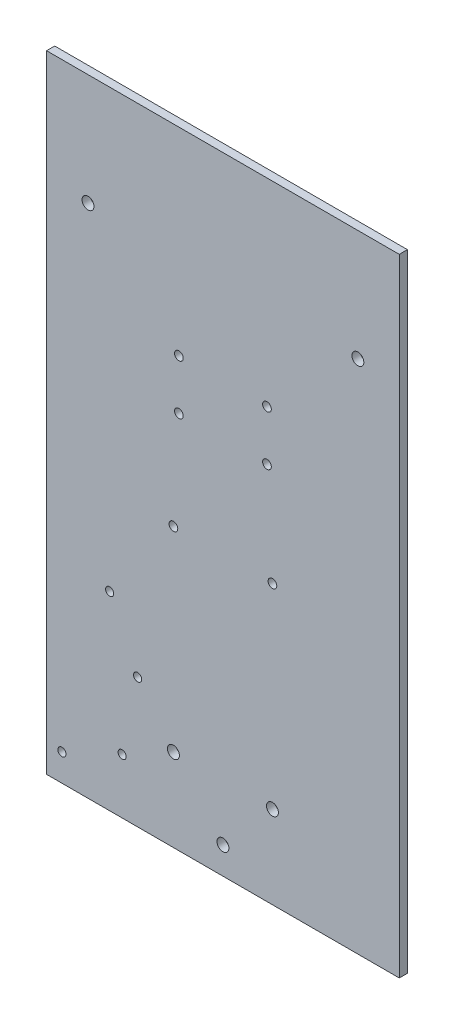
ISO-10303-21;
HEADER;
FILE_DESCRIPTION(('STEP AP214'),'2;1');
FILE_NAME('part.step','',(''),(''),'','','');
FILE_SCHEMA(('AUTOMOTIVE_DESIGN { 1 0 10303 214 1 1 1 1 }'));
ENDSEC;
DATA;
#1=APPLICATION_CONTEXT('core data for automotive mechanical design processes');
#2=APPLICATION_PROTOCOL_DEFINITION('international standard','automotive_design',2000,#1);
#3=PRODUCT_CONTEXT('',#1,'mechanical');
#4=PRODUCT('Part','Part','',(#3));
#5=PRODUCT_RELATED_PRODUCT_CATEGORY('part','',(#4));
#6=PRODUCT_DEFINITION_FORMATION('','',#4);
#7=PRODUCT_DEFINITION_CONTEXT('part definition',#1,'design');
#8=PRODUCT_DEFINITION('design','',#6,#7);
#9=PRODUCT_DEFINITION_SHAPE('','',#8);
#10=(LENGTH_UNIT() NAMED_UNIT(*) SI_UNIT(.MILLI.,.METRE.));
#11=(NAMED_UNIT(*) PLANE_ANGLE_UNIT() SI_UNIT($,.RADIAN.));
#12=(NAMED_UNIT(*) SI_UNIT($,.STERADIAN.) SOLID_ANGLE_UNIT());
#13=UNCERTAINTY_MEASURE_WITH_UNIT(LENGTH_MEASURE(1.E-05),#10,'distance_accuracy_value','');
#14=(GEOMETRIC_REPRESENTATION_CONTEXT(3) GLOBAL_UNCERTAINTY_ASSIGNED_CONTEXT((#13)) GLOBAL_UNIT_ASSIGNED_CONTEXT((#10,
#11,#12)) REPRESENTATION_CONTEXT('',''));
#15=CARTESIAN_POINT('',(0.,0.,0.));
#16=DIRECTION('',(0.,0.,1.));
#17=DIRECTION('',(1.,0.,0.));
#18=AXIS2_PLACEMENT_3D('',#15,#16,#17);
#19=CARTESIAN_POINT('',(-75.,115.5,12.5));
#20=DIRECTION('',(0.,-1.,0.));
#21=DIRECTION('',(0.,0.,-1.));
#22=AXIS2_PLACEMENT_3D('',#19,#20,#21);
#23=PLANE('',#22);
#24=DIRECTION('',(-1.,0.,0.));
#25=VECTOR('',#24,1.);
#26=CARTESIAN_POINT('',(65.,115.5,3.));
#27=LINE('',#26,#25);
#28=CARTESIAN_POINT('',(65.,115.5,3.));
#29=VERTEX_POINT('',#28);
#30=CARTESIAN_POINT('',(-65.,115.5,3.));
#31=VERTEX_POINT('',#30);
#32=EDGE_CURVE('E80',#29,#31,#27,.T.);
#33=ORIENTED_EDGE('',*,*,#32,.F.);
#34=DIRECTION('',(0.,0.,1.));
#35=VECTOR('',#34,1.);
#36=CARTESIAN_POINT('',(65.,115.5,0.));
#37=LINE('',#36,#35);
#38=CARTESIAN_POINT('',(65.,115.5,0.));
#39=VERTEX_POINT('',#38);
#40=EDGE_CURVE('E88',#39,#29,#37,.T.);
#41=ORIENTED_EDGE('',*,*,#40,.F.);
#42=DIRECTION('',(-1.,0.,0.));
#43=VECTOR('',#42,1.);
#44=CARTESIAN_POINT('',(-75.,115.5,0.));
#45=LINE('',#44,#43);
#46=CARTESIAN_POINT('',(-65.,115.5,0.));
#47=VERTEX_POINT('',#46);
#48=EDGE_CURVE('E46',#39,#47,#45,.T.);
#49=ORIENTED_EDGE('',*,*,#48,.T.);
#50=DIRECTION('',(0.,0.,1.));
#51=VECTOR('',#50,1.);
#52=CARTESIAN_POINT('',(-65.,115.5,0.));
#53=LINE('',#52,#51);
#54=EDGE_CURVE('E91',#47,#31,#53,.T.);
#55=ORIENTED_EDGE('',*,*,#54,.T.);
#56=EDGE_LOOP('',(#33,#41,#49,#55));
#57=FACE_BOUND('',#56,.T.);
#58=ADVANCED_FACE('F38',(#57),#23,.F.);
#59=CARTESIAN_POINT('',(-75.,-115.5,12.5));
#60=DIRECTION('',(0.,1.,0.));
#61=DIRECTION('',(0.,0.,1.));
#62=AXIS2_PLACEMENT_3D('',#59,#60,#61);
#63=PLANE('',#62);
#64=DIRECTION('',(1.,0.,0.));
#65=VECTOR('',#64,1.);
#66=CARTESIAN_POINT('',(65.,-115.5,3.));
#67=LINE('',#66,#65);
#68=CARTESIAN_POINT('',(-65.,-115.5,3.));
#69=VERTEX_POINT('',#68);
#70=CARTESIAN_POINT('',(65.,-115.5,3.));
#71=VERTEX_POINT('',#70);
#72=EDGE_CURVE('E53',#69,#71,#67,.T.);
#73=ORIENTED_EDGE('',*,*,#72,.F.);
#74=DIRECTION('',(0.,0.,1.));
#75=VECTOR('',#74,1.);
#76=CARTESIAN_POINT('',(-65.,-115.5,0.));
#77=LINE('',#76,#75);
#78=CARTESIAN_POINT('',(-65.,-115.5,0.));
#79=VERTEX_POINT('',#78);
#80=EDGE_CURVE('E109',#79,#69,#77,.T.);
#81=ORIENTED_EDGE('',*,*,#80,.F.);
#82=DIRECTION('',(1.,0.,0.));
#83=VECTOR('',#82,1.);
#84=CARTESIAN_POINT('',(-75.,-115.5,0.));
#85=LINE('',#84,#83);
#86=CARTESIAN_POINT('',(65.,-115.5,0.));
#87=VERTEX_POINT('',#86);
#88=EDGE_CURVE('E11',#79,#87,#85,.T.);
#89=ORIENTED_EDGE('',*,*,#88,.T.);
#90=DIRECTION('',(0.,0.,1.));
#91=VECTOR('',#90,1.);
#92=CARTESIAN_POINT('',(65.,-115.5,0.));
#93=LINE('',#92,#91);
#94=EDGE_CURVE('E60',#87,#71,#93,.T.);
#95=ORIENTED_EDGE('',*,*,#94,.T.);
#96=EDGE_LOOP('',(#73,#81,#89,#95));
#97=FACE_BOUND('',#96,.T.);
#98=ADVANCED_FACE('F190',(#97),#63,.F.);
#99=CARTESIAN_POINT('',(49.73,74.5,0.));
#100=DIRECTION('',(0.,0.,1.));
#101=DIRECTION('',(1.,0.,0.));
#102=AXIS2_PLACEMENT_3D('',#99,#100,#101);
#103=CYLINDRICAL_SURFACE('',#102,2.2);
#104=CARTESIAN_POINT('',(49.73,74.5,0.));
#105=DIRECTION('',(0.,0.,1.));
#106=DIRECTION('',(1.,0.,0.));
#107=AXIS2_PLACEMENT_3D('',#104,#105,#106);
#108=CIRCLE('',#107,2.2);
#109=CARTESIAN_POINT('',(51.93,74.5,0.));
#110=VERTEX_POINT('',#109);
#111=EDGE_CURVE('E175',#110,#110,#108,.T.);
#112=ORIENTED_EDGE('',*,*,#111,.F.);
#113=EDGE_LOOP('',(#112));
#114=FACE_BOUND('',#113,.T.);
#115=CARTESIAN_POINT('',(49.73,74.5,3.));
#116=DIRECTION('',(0.,0.,1.));
#117=DIRECTION('',(1.,0.,0.));
#118=AXIS2_PLACEMENT_3D('',#115,#116,#117);
#119=CIRCLE('',#118,2.2);
#120=CARTESIAN_POINT('',(51.93,74.5,3.));
#121=VERTEX_POINT('',#120);
#122=EDGE_CURVE('E252',#121,#121,#119,.F.);
#123=ORIENTED_EDGE('',*,*,#122,.F.);
#124=EDGE_LOOP('',(#123));
#125=FACE_BOUND('',#124,.T.);
#126=ADVANCED_FACE('F299',(#114,#125),#103,.F.);
#127=CARTESIAN_POINT('',(-49.73,74.5,0.));
#128=DIRECTION('',(0.,0.,1.));
#129=DIRECTION('',(1.,0.,0.));
#130=AXIS2_PLACEMENT_3D('',#127,#128,#129);
#131=CYLINDRICAL_SURFACE('',#130,2.2);
#132=CARTESIAN_POINT('',(-49.73,74.5,0.));
#133=DIRECTION('',(0.,0.,1.));
#134=DIRECTION('',(1.,0.,0.));
#135=AXIS2_PLACEMENT_3D('',#132,#133,#134);
#136=CIRCLE('',#135,2.2);
#137=CARTESIAN_POINT('',(-47.53,74.5,0.));
#138=VERTEX_POINT('',#137);
#139=EDGE_CURVE('E176',#138,#138,#136,.T.);
#140=ORIENTED_EDGE('',*,*,#139,.F.);
#141=EDGE_LOOP('',(#140));
#142=FACE_BOUND('',#141,.T.);
#143=CARTESIAN_POINT('',(-49.73,74.5,3.));
#144=DIRECTION('',(0.,0.,1.));
#145=DIRECTION('',(1.,0.,0.));
#146=AXIS2_PLACEMENT_3D('',#143,#144,#145);
#147=CIRCLE('',#146,2.2);
#148=CARTESIAN_POINT('',(-47.53,74.5,3.));
#149=VERTEX_POINT('',#148);
#150=EDGE_CURVE('E248',#149,#149,#147,.F.);
#151=ORIENTED_EDGE('',*,*,#150,.F.);
#152=EDGE_LOOP('',(#151));
#153=FACE_BOUND('',#152,.T.);
#154=ADVANCED_FACE('F302',(#142,#153),#131,.F.);
#155=CARTESIAN_POINT('',(-18.25,-12.95,0.));
#156=DIRECTION('',(0.,0.,1.));
#157=DIRECTION('',(1.,0.,0.));
#158=AXIS2_PLACEMENT_3D('',#155,#156,#157);
#159=CYLINDRICAL_SURFACE('',#158,1.6);
#160=CARTESIAN_POINT('',(-18.25,-12.95,0.));
#161=DIRECTION('',(0.,0.,1.));
#162=DIRECTION('',(1.,0.,0.));
#163=AXIS2_PLACEMENT_3D('',#160,#161,#162);
#164=CIRCLE('',#163,1.6);
#165=CARTESIAN_POINT('',(-16.65,-12.95,0.));
#166=VERTEX_POINT('',#165);
#167=EDGE_CURVE('E160',#166,#166,#164,.T.);
#168=ORIENTED_EDGE('',*,*,#167,.F.);
#169=EDGE_LOOP('',(#168));
#170=FACE_BOUND('',#169,.T.);
#171=CARTESIAN_POINT('',(-18.25,-12.95,3.));
#172=DIRECTION('',(0.,0.,1.));
#173=DIRECTION('',(1.,0.,0.));
#174=AXIS2_PLACEMENT_3D('',#171,#172,#173);
#175=CIRCLE('',#174,1.6);
#176=CARTESIAN_POINT('',(-16.65,-12.95,3.));
#177=VERTEX_POINT('',#176);
#178=EDGE_CURVE('E244',#177,#177,#175,.F.);
#179=ORIENTED_EDGE('',*,*,#178,.F.);
#180=EDGE_LOOP('',(#179));
#181=FACE_BOUND('',#180,.T.);
#182=ADVANCED_FACE('F322',(#170,#181),#159,.F.);
#183=CARTESIAN_POINT('',(-31.45,-67.68,0.));
#184=DIRECTION('',(0.,0.,1.));
#185=DIRECTION('',(1.,0.,0.));
#186=AXIS2_PLACEMENT_3D('',#183,#184,#185);
#187=CYLINDRICAL_SURFACE('',#186,1.5);
#188=CARTESIAN_POINT('',(-31.45,-67.68,0.));
#189=DIRECTION('',(0.,0.,1.));
#190=DIRECTION('',(1.,0.,0.));
#191=AXIS2_PLACEMENT_3D('',#188,#189,#190);
#192=CIRCLE('',#191,1.5);
#193=CARTESIAN_POINT('',(-29.95,-67.68,0.));
#194=VERTEX_POINT('',#193);
#195=EDGE_CURVE('E148',#194,#194,#192,.T.);
#196=ORIENTED_EDGE('',*,*,#195,.F.);
#197=EDGE_LOOP('',(#196));
#198=FACE_BOUND('',#197,.T.);
#199=CARTESIAN_POINT('',(-31.45,-67.68,3.));
#200=DIRECTION('',(0.,0.,1.));
#201=DIRECTION('',(1.,0.,0.));
#202=AXIS2_PLACEMENT_3D('',#199,#200,#201);
#203=CIRCLE('',#202,1.5);
#204=CARTESIAN_POINT('',(-29.95,-67.68,3.));
#205=VERTEX_POINT('',#204);
#206=EDGE_CURVE('E240',#205,#205,#203,.F.);
#207=ORIENTED_EDGE('',*,*,#206,.F.);
#208=EDGE_LOOP('',(#207));
#209=FACE_BOUND('',#208,.T.);
#210=ADVANCED_FACE('F326',(#198,#209),#187,.F.);
#211=CARTESIAN_POINT('',(-41.75,-45.48,0.));
#212=DIRECTION('',(0.,0.,1.));
#213=DIRECTION('',(1.,0.,0.));
#214=AXIS2_PLACEMENT_3D('',#211,#212,#213);
#215=CYLINDRICAL_SURFACE('',#214,1.5);
#216=CARTESIAN_POINT('',(-41.75,-45.48,0.));
#217=DIRECTION('',(0.,0.,1.));
#218=DIRECTION('',(1.,0.,0.));
#219=AXIS2_PLACEMENT_3D('',#216,#217,#218);
#220=CIRCLE('',#219,1.5);
#221=CARTESIAN_POINT('',(-40.25,-45.48,0.));
#222=VERTEX_POINT('',#221);
#223=EDGE_CURVE('E144',#222,#222,#220,.T.);
#224=ORIENTED_EDGE('',*,*,#223,.F.);
#225=EDGE_LOOP('',(#224));
#226=FACE_BOUND('',#225,.T.);
#227=CARTESIAN_POINT('',(-41.75,-45.48,3.));
#228=DIRECTION('',(0.,0.,1.));
#229=DIRECTION('',(1.,0.,0.));
#230=AXIS2_PLACEMENT_3D('',#227,#228,#229);
#231=CIRCLE('',#230,1.5);
#232=CARTESIAN_POINT('',(-40.25,-45.48,3.));
#233=VERTEX_POINT('',#232);
#234=EDGE_CURVE('E236',#233,#233,#231,.F.);
#235=ORIENTED_EDGE('',*,*,#234,.F.);
#236=EDGE_LOOP('',(#235));
#237=FACE_BOUND('',#236,.T.);
#238=ADVANCED_FACE('F346',(#226,#237),#215,.F.);
#239=CARTESIAN_POINT('',(18.25,-12.95,0.));
#240=DIRECTION('',(0.,0.,1.));
#241=DIRECTION('',(1.,0.,0.));
#242=AXIS2_PLACEMENT_3D('',#239,#240,#241);
#243=CYLINDRICAL_SURFACE('',#242,1.6);
#244=CARTESIAN_POINT('',(18.25,-12.95,0.));
#245=DIRECTION('',(0.,0.,1.));
#246=DIRECTION('',(1.,0.,0.));
#247=AXIS2_PLACEMENT_3D('',#244,#245,#246);
#248=CIRCLE('',#247,1.6);
#249=CARTESIAN_POINT('',(19.85,-12.95,0.));
#250=VERTEX_POINT('',#249);
#251=EDGE_CURVE('E140',#250,#250,#248,.T.);
#252=ORIENTED_EDGE('',*,*,#251,.F.);
#253=EDGE_LOOP('',(#252));
#254=FACE_BOUND('',#253,.T.);
#255=CARTESIAN_POINT('',(18.25,-12.95,3.));
#256=DIRECTION('',(0.,0.,1.));
#257=DIRECTION('',(1.,0.,0.));
#258=AXIS2_PLACEMENT_3D('',#255,#256,#257);
#259=CIRCLE('',#258,1.6);
#260=CARTESIAN_POINT('',(19.85,-12.95,3.));
#261=VERTEX_POINT('',#260);
#262=EDGE_CURVE('E232',#261,#261,#259,.F.);
#263=ORIENTED_EDGE('',*,*,#262,.F.);
#264=EDGE_LOOP('',(#263));
#265=FACE_BOUND('',#264,.T.);
#266=ADVANCED_FACE('F349',(#254,#265),#243,.F.);
#267=CARTESIAN_POINT('',(-59.34,-105.5,0.));
#268=DIRECTION('',(0.,0.,1.));
#269=DIRECTION('',(1.,0.,0.));
#270=AXIS2_PLACEMENT_3D('',#267,#268,#269);
#271=CYLINDRICAL_SURFACE('',#270,1.5);
#272=CARTESIAN_POINT('',(-59.34,-105.5,0.));
#273=DIRECTION('',(0.,0.,1.));
#274=DIRECTION('',(1.,0.,0.));
#275=AXIS2_PLACEMENT_3D('',#272,#273,#274);
#276=CIRCLE('',#275,1.5);
#277=CARTESIAN_POINT('',(-57.84,-105.5,0.));
#278=VERTEX_POINT('',#277);
#279=EDGE_CURVE('E139',#278,#278,#276,.T.);
#280=ORIENTED_EDGE('',*,*,#279,.F.);
#281=EDGE_LOOP('',(#280));
#282=FACE_BOUND('',#281,.T.);
#283=CARTESIAN_POINT('',(-59.34,-105.5,3.));
#284=DIRECTION('',(0.,0.,1.));
#285=DIRECTION('',(1.,0.,0.));
#286=AXIS2_PLACEMENT_3D('',#283,#284,#285);
#287=CIRCLE('',#286,1.5);
#288=CARTESIAN_POINT('',(-57.84,-105.5,3.));
#289=VERTEX_POINT('',#288);
#290=EDGE_CURVE('E228',#289,#289,#287,.F.);
#291=ORIENTED_EDGE('',*,*,#290,.F.);
#292=EDGE_LOOP('',(#291));
#293=FACE_BOUND('',#292,.T.);
#294=ADVANCED_FACE('F332',(#282,#293),#271,.F.);
#295=CARTESIAN_POINT('',(-37.14,-95.2,0.));
#296=DIRECTION('',(0.,0.,1.));
#297=DIRECTION('',(1.,0.,0.));
#298=AXIS2_PLACEMENT_3D('',#295,#296,#297);
#299=CYLINDRICAL_SURFACE('',#298,1.5);
#300=CARTESIAN_POINT('',(-37.14,-95.2,0.));
#301=DIRECTION('',(0.,0.,1.));
#302=DIRECTION('',(1.,0.,0.));
#303=AXIS2_PLACEMENT_3D('',#300,#301,#302);
#304=CIRCLE('',#303,1.5);
#305=CARTESIAN_POINT('',(-35.64,-95.2,0.));
#306=VERTEX_POINT('',#305);
#307=EDGE_CURVE('E152',#306,#306,#304,.T.);
#308=ORIENTED_EDGE('',*,*,#307,.F.);
#309=EDGE_LOOP('',(#308));
#310=FACE_BOUND('',#309,.T.);
#311=CARTESIAN_POINT('',(-37.14,-95.2,3.));
#312=DIRECTION('',(0.,0.,1.));
#313=DIRECTION('',(1.,0.,0.));
#314=AXIS2_PLACEMENT_3D('',#311,#312,#313);
#315=CIRCLE('',#314,1.5);
#316=CARTESIAN_POINT('',(-35.64,-95.2,3.));
#317=VERTEX_POINT('',#316);
#318=EDGE_CURVE('E224',#317,#317,#315,.F.);
#319=ORIENTED_EDGE('',*,*,#318,.F.);
#320=EDGE_LOOP('',(#319));
#321=FACE_BOUND('',#320,.T.);
#322=ADVANCED_FACE('F328',(#310,#321),#299,.F.);
#323=CARTESIAN_POINT('',(-18.25,-85.,0.));
#324=DIRECTION('',(0.,0.,1.));
#325=DIRECTION('',(1.,0.,0.));
#326=AXIS2_PLACEMENT_3D('',#323,#324,#325);
#327=CYLINDRICAL_SURFACE('',#326,2.2);
#328=CARTESIAN_POINT('',(-18.25,-85.,0.));
#329=DIRECTION('',(0.,0.,1.));
#330=DIRECTION('',(1.,0.,0.));
#331=AXIS2_PLACEMENT_3D('',#328,#329,#330);
#332=CIRCLE('',#331,2.2);
#333=CARTESIAN_POINT('',(-16.05,-85.,0.));
#334=VERTEX_POINT('',#333);
#335=EDGE_CURVE('E165',#334,#334,#332,.T.);
#336=ORIENTED_EDGE('',*,*,#335,.F.);
#337=EDGE_LOOP('',(#336));
#338=FACE_BOUND('',#337,.T.);
#339=CARTESIAN_POINT('',(-18.25,-85.,3.));
#340=DIRECTION('',(0.,0.,1.));
#341=DIRECTION('',(1.,0.,0.));
#342=AXIS2_PLACEMENT_3D('',#339,#340,#341);
#343=CIRCLE('',#342,2.2);
#344=CARTESIAN_POINT('',(-16.05,-85.,3.));
#345=VERTEX_POINT('',#344);
#346=EDGE_CURVE('E220',#345,#345,#343,.F.);
#347=ORIENTED_EDGE('',*,*,#346,.F.);
#348=EDGE_LOOP('',(#347));
#349=FACE_BOUND('',#348,.T.);
#350=ADVANCED_FACE('F331',(#338,#349),#327,.F.);
#351=CARTESIAN_POINT('',(0.,-105.5,0.));
#352=DIRECTION('',(0.,0.,1.));
#353=DIRECTION('',(1.,0.,0.));
#354=AXIS2_PLACEMENT_3D('',#351,#352,#353);
#355=CYLINDRICAL_SURFACE('',#354,2.2);
#356=CARTESIAN_POINT('',(0.,-105.5,0.));
#357=DIRECTION('',(0.,0.,1.));
#358=DIRECTION('',(1.,0.,0.));
#359=AXIS2_PLACEMENT_3D('',#356,#357,#358);
#360=CIRCLE('',#359,2.2);
#361=CARTESIAN_POINT('',(2.2,-105.5,0.));
#362=VERTEX_POINT('',#361);
#363=EDGE_CURVE('E161',#362,#362,#360,.T.);
#364=ORIENTED_EDGE('',*,*,#363,.F.);
#365=EDGE_LOOP('',(#364));
#366=FACE_BOUND('',#365,.T.);
#367=CARTESIAN_POINT('',(0.,-105.5,3.));
#368=DIRECTION('',(0.,0.,1.));
#369=DIRECTION('',(1.,0.,0.));
#370=AXIS2_PLACEMENT_3D('',#367,#368,#369);
#371=CIRCLE('',#370,2.2);
#372=CARTESIAN_POINT('',(2.2,-105.5,3.));
#373=VERTEX_POINT('',#372);
#374=EDGE_CURVE('E216',#373,#373,#371,.F.);
#375=ORIENTED_EDGE('',*,*,#374,.F.);
#376=EDGE_LOOP('',(#375));
#377=FACE_BOUND('',#376,.T.);
#378=ADVANCED_FACE('F336',(#366,#377),#355,.F.);
#379=CARTESIAN_POINT('',(18.25,-85.,0.));
#380=DIRECTION('',(0.,0.,1.));
#381=DIRECTION('',(1.,0.,0.));
#382=AXIS2_PLACEMENT_3D('',#379,#380,#381);
#383=CYLINDRICAL_SURFACE('',#382,2.2);
#384=CARTESIAN_POINT('',(18.25,-85.,0.));
#385=DIRECTION('',(0.,0.,1.));
#386=DIRECTION('',(1.,0.,0.));
#387=AXIS2_PLACEMENT_3D('',#384,#385,#386);
#388=CIRCLE('',#387,2.2);
#389=CARTESIAN_POINT('',(20.45,-85.,0.));
#390=VERTEX_POINT('',#389);
#391=EDGE_CURVE('E156',#390,#390,#388,.T.);
#392=ORIENTED_EDGE('',*,*,#391,.F.);
#393=EDGE_LOOP('',(#392));
#394=FACE_BOUND('',#393,.T.);
#395=CARTESIAN_POINT('',(18.25,-85.,3.));
#396=DIRECTION('',(0.,0.,1.));
#397=DIRECTION('',(1.,0.,0.));
#398=AXIS2_PLACEMENT_3D('',#395,#396,#397);
#399=CIRCLE('',#398,2.2);
#400=CARTESIAN_POINT('',(20.45,-85.,3.));
#401=VERTEX_POINT('',#400);
#402=EDGE_CURVE('E212',#401,#401,#399,.F.);
#403=ORIENTED_EDGE('',*,*,#402,.F.);
#404=EDGE_LOOP('',(#403));
#405=FACE_BOUND('',#404,.T.);
#406=ADVANCED_FACE('F340',(#394,#405),#383,.F.);
#407=CARTESIAN_POINT('',(-16.23,42.5,-8.));
#408=DIRECTION('',(0.,0.,1.));
#409=DIRECTION('',(1.,0.,0.));
#410=AXIS2_PLACEMENT_3D('',#407,#408,#409);
#411=CYLINDRICAL_SURFACE('',#410,1.6);
#412=CARTESIAN_POINT('',(-16.23,42.5,0.));
#413=DIRECTION('',(0.,0.,1.));
#414=DIRECTION('',(1.,0.,0.));
#415=AXIS2_PLACEMENT_3D('',#412,#413,#414);
#416=CIRCLE('',#415,1.6);
#417=CARTESIAN_POINT('',(-14.63,42.5,0.));
#418=VERTEX_POINT('',#417);
#419=EDGE_CURVE('E115',#418,#418,#416,.T.);
#420=ORIENTED_EDGE('',*,*,#419,.F.);
#421=EDGE_LOOP('',(#420));
#422=FACE_BOUND('',#421,.T.);
#423=CARTESIAN_POINT('',(-16.23,42.5,3.));
#424=DIRECTION('',(0.,0.,1.));
#425=DIRECTION('',(1.,0.,0.));
#426=AXIS2_PLACEMENT_3D('',#423,#424,#425);
#427=CIRCLE('',#426,1.6);
#428=CARTESIAN_POINT('',(-14.63,42.5,3.));
#429=VERTEX_POINT('',#428);
#430=EDGE_CURVE('E208',#429,#429,#427,.F.);
#431=ORIENTED_EDGE('',*,*,#430,.F.);
#432=EDGE_LOOP('',(#431));
#433=FACE_BOUND('',#432,.T.);
#434=ADVANCED_FACE('F344',(#422,#433),#411,.F.);
#435=CARTESIAN_POINT('',(16.23,24.1,-8.));
#436=DIRECTION('',(0.,0.,1.));
#437=DIRECTION('',(1.,0.,0.));
#438=AXIS2_PLACEMENT_3D('',#435,#436,#437);
#439=CYLINDRICAL_SURFACE('',#438,1.6);
#440=CARTESIAN_POINT('',(16.23,24.1,0.));
#441=DIRECTION('',(0.,0.,1.));
#442=DIRECTION('',(1.,0.,0.));
#443=AXIS2_PLACEMENT_3D('',#440,#441,#442);
#444=CIRCLE('',#443,1.6);
#445=CARTESIAN_POINT('',(17.83,24.1,0.));
#446=VERTEX_POINT('',#445);
#447=EDGE_CURVE('E119',#446,#446,#444,.T.);
#448=ORIENTED_EDGE('',*,*,#447,.F.);
#449=EDGE_LOOP('',(#448));
#450=FACE_BOUND('',#449,.T.);
#451=CARTESIAN_POINT('',(16.23,24.1,3.));
#452=DIRECTION('',(0.,0.,1.));
#453=DIRECTION('',(1.,0.,0.));
#454=AXIS2_PLACEMENT_3D('',#451,#452,#453);
#455=CIRCLE('',#454,1.6);
#456=CARTESIAN_POINT('',(17.83,24.1,3.));
#457=VERTEX_POINT('',#456);
#458=EDGE_CURVE('E204',#457,#457,#455,.F.);
#459=ORIENTED_EDGE('',*,*,#458,.F.);
#460=EDGE_LOOP('',(#459));
#461=FACE_BOUND('',#460,.T.);
#462=ADVANCED_FACE('F365',(#450,#461),#439,.F.);
#463=CARTESIAN_POINT('',(16.23,42.5,-8.));
#464=DIRECTION('',(0.,0.,1.));
#465=DIRECTION('',(1.,0.,0.));
#466=AXIS2_PLACEMENT_3D('',#463,#464,#465);
#467=CYLINDRICAL_SURFACE('',#466,1.6);
#468=CARTESIAN_POINT('',(16.23,42.5,0.));
#469=DIRECTION('',(0.,0.,1.));
#470=DIRECTION('',(1.,0.,0.));
#471=AXIS2_PLACEMENT_3D('',#468,#469,#470);
#472=CIRCLE('',#471,1.6);
#473=CARTESIAN_POINT('',(17.83,42.5,0.));
#474=VERTEX_POINT('',#473);
#475=EDGE_CURVE('E123',#474,#474,#472,.T.);
#476=ORIENTED_EDGE('',*,*,#475,.F.);
#477=EDGE_LOOP('',(#476));
#478=FACE_BOUND('',#477,.T.);
#479=CARTESIAN_POINT('',(16.23,42.5,3.));
#480=DIRECTION('',(0.,0.,1.));
#481=DIRECTION('',(1.,0.,0.));
#482=AXIS2_PLACEMENT_3D('',#479,#480,#481);
#483=CIRCLE('',#482,1.6);
#484=CARTESIAN_POINT('',(17.83,42.5,3.));
#485=VERTEX_POINT('',#484);
#486=EDGE_CURVE('E197',#485,#485,#483,.F.);
#487=ORIENTED_EDGE('',*,*,#486,.F.);
#488=EDGE_LOOP('',(#487));
#489=FACE_BOUND('',#488,.T.);
#490=ADVANCED_FACE('F367',(#478,#489),#467,.F.);
#491=CARTESIAN_POINT('',(-16.23,24.1,-8.));
#492=DIRECTION('',(0.,0.,1.));
#493=DIRECTION('',(1.,0.,0.));
#494=AXIS2_PLACEMENT_3D('',#491,#492,#493);
#495=CYLINDRICAL_SURFACE('',#494,1.6);
#496=CARTESIAN_POINT('',(-16.23,24.1,0.));
#497=DIRECTION('',(0.,0.,1.));
#498=DIRECTION('',(1.,0.,0.));
#499=AXIS2_PLACEMENT_3D('',#496,#497,#498);
#500=CIRCLE('',#499,1.6);
#501=CARTESIAN_POINT('',(-14.63,24.1,0.));
#502=VERTEX_POINT('',#501);
#503=EDGE_CURVE('E127',#502,#502,#500,.T.);
#504=ORIENTED_EDGE('',*,*,#503,.F.);
#505=EDGE_LOOP('',(#504));
#506=FACE_BOUND('',#505,.T.);
#507=CARTESIAN_POINT('',(-16.23,24.1,3.));
#508=DIRECTION('',(0.,0.,1.));
#509=DIRECTION('',(1.,0.,0.));
#510=AXIS2_PLACEMENT_3D('',#507,#508,#509);
#511=CIRCLE('',#510,1.6);
#512=CARTESIAN_POINT('',(-14.63,24.1,3.));
#513=VERTEX_POINT('',#512);
#514=EDGE_CURVE('E192',#513,#513,#511,.F.);
#515=ORIENTED_EDGE('',*,*,#514,.F.);
#516=EDGE_LOOP('',(#515));
#517=FACE_BOUND('',#516,.T.);
#518=ADVANCED_FACE('F370',(#506,#517),#495,.F.);
#519=CARTESIAN_POINT('',(-65.,-115.5,0.));
#520=DIRECTION('',(1.,0.,0.));
#521=DIRECTION('',(0.,0.,-1.));
#522=AXIS2_PLACEMENT_3D('',#519,#520,#521);
#523=PLANE('',#522);
#524=DIRECTION('',(0.,-1.,0.));
#525=VECTOR('',#524,1.);
#526=CARTESIAN_POINT('',(-65.,-115.5,3.));
#527=LINE('',#526,#525);
#528=EDGE_CURVE('E93',#31,#69,#527,.T.);
#529=ORIENTED_EDGE('',*,*,#528,.F.);
#530=ORIENTED_EDGE('',*,*,#54,.F.);
#531=DIRECTION('',(0.,1.,0.));
#532=VECTOR('',#531,1.);
#533=CARTESIAN_POINT('',(-65.,-115.5,0.));
#534=LINE('',#533,#532);
#535=EDGE_CURVE('E101',#79,#47,#534,.T.);
#536=ORIENTED_EDGE('',*,*,#535,.F.);
#537=ORIENTED_EDGE('',*,*,#80,.T.);
#538=EDGE_LOOP('',(#529,#530,#536,#537));
#539=FACE_BOUND('',#538,.T.);
#540=ADVANCED_FACE('F185',(#539),#523,.F.);
#541=CARTESIAN_POINT('',(65.,-115.5,0.));
#542=DIRECTION('',(-1.,0.,0.));
#543=DIRECTION('',(0.,0.,1.));
#544=AXIS2_PLACEMENT_3D('',#541,#542,#543);
#545=PLANE('',#544);
#546=DIRECTION('',(0.,1.,0.));
#547=VECTOR('',#546,1.);
#548=CARTESIAN_POINT('',(65.,-115.5,3.));
#549=LINE('',#548,#547);
#550=EDGE_CURVE('E76',#71,#29,#549,.T.);
#551=ORIENTED_EDGE('',*,*,#550,.F.);
#552=ORIENTED_EDGE('',*,*,#94,.F.);
#553=DIRECTION('',(0.,-1.,0.));
#554=VECTOR('',#553,1.);
#555=CARTESIAN_POINT('',(65.,-115.5,0.));
#556=LINE('',#555,#554);
#557=EDGE_CURVE('E96',#39,#87,#556,.T.);
#558=ORIENTED_EDGE('',*,*,#557,.F.);
#559=ORIENTED_EDGE('',*,*,#40,.T.);
#560=EDGE_LOOP('',(#551,#552,#558,#559));
#561=FACE_BOUND('',#560,.T.);
#562=ADVANCED_FACE('F95',(#561),#545,.F.);
#563=CARTESIAN_POINT('',(0.,0.,0.));
#564=DIRECTION('',(0.,0.,1.));
#565=DIRECTION('',(1.,0.,0.));
#566=AXIS2_PLACEMENT_3D('',#563,#564,#565);
#567=PLANE('',#566);
#568=ORIENTED_EDGE('',*,*,#503,.T.);
#569=EDGE_LOOP('',(#568));
#570=FACE_BOUND('',#569,.T.);
#571=ORIENTED_EDGE('',*,*,#475,.T.);
#572=EDGE_LOOP('',(#571));
#573=FACE_BOUND('',#572,.T.);
#574=ORIENTED_EDGE('',*,*,#447,.T.);
#575=EDGE_LOOP('',(#574));
#576=FACE_BOUND('',#575,.T.);
#577=ORIENTED_EDGE('',*,*,#419,.T.);
#578=EDGE_LOOP('',(#577));
#579=FACE_BOUND('',#578,.T.);
#580=CARTESIAN_POINT('',(-12.5,105.5,0.));
#581=DIRECTION('',(0.,0.,1.));
#582=DIRECTION('',(1.,0.,0.));
#583=AXIS2_PLACEMENT_3D('',#580,#581,#582);
#584=CIRCLE('',#583,1.5);
#585=CARTESIAN_POINT('',(-11.,105.5,0.));
#586=VERTEX_POINT('',#585);
#587=EDGE_CURVE('E135',#586,#586,#584,.T.);
#588=ORIENTED_EDGE('',*,*,#587,.T.);
#589=EDGE_LOOP('',(#588));
#590=FACE_BOUND('',#589,.T.);
#591=CARTESIAN_POINT('',(12.5,105.5,0.));
#592=DIRECTION('',(0.,0.,1.));
#593=DIRECTION('',(1.,0.,0.));
#594=AXIS2_PLACEMENT_3D('',#591,#592,#593);
#595=CIRCLE('',#594,1.5);
#596=CARTESIAN_POINT('',(14.,105.5,0.));
#597=VERTEX_POINT('',#596);
#598=EDGE_CURVE('E131',#597,#597,#595,.T.);
#599=ORIENTED_EDGE('',*,*,#598,.T.);
#600=EDGE_LOOP('',(#599));
#601=FACE_BOUND('',#600,.T.);
#602=ORIENTED_EDGE('',*,*,#391,.T.);
#603=EDGE_LOOP('',(#602));
#604=FACE_BOUND('',#603,.T.);
#605=ORIENTED_EDGE('',*,*,#363,.T.);
#606=EDGE_LOOP('',(#605));
#607=FACE_BOUND('',#606,.T.);
#608=ORIENTED_EDGE('',*,*,#335,.T.);
#609=EDGE_LOOP('',(#608));
#610=FACE_BOUND('',#609,.T.);
#611=ORIENTED_EDGE('',*,*,#307,.T.);
#612=EDGE_LOOP('',(#611));
#613=FACE_BOUND('',#612,.T.);
#614=ORIENTED_EDGE('',*,*,#279,.T.);
#615=EDGE_LOOP('',(#614));
#616=FACE_BOUND('',#615,.T.);
#617=ORIENTED_EDGE('',*,*,#251,.T.);
#618=EDGE_LOOP('',(#617));
#619=FACE_BOUND('',#618,.T.);
#620=ORIENTED_EDGE('',*,*,#223,.T.);
#621=EDGE_LOOP('',(#620));
#622=FACE_BOUND('',#621,.T.);
#623=ORIENTED_EDGE('',*,*,#195,.T.);
#624=EDGE_LOOP('',(#623));
#625=FACE_BOUND('',#624,.T.);
#626=ORIENTED_EDGE('',*,*,#167,.T.);
#627=EDGE_LOOP('',(#626));
#628=FACE_BOUND('',#627,.T.);
#629=ORIENTED_EDGE('',*,*,#139,.T.);
#630=EDGE_LOOP('',(#629));
#631=FACE_BOUND('',#630,.T.);
#632=ORIENTED_EDGE('',*,*,#111,.T.);
#633=EDGE_LOOP('',(#632));
#634=FACE_BOUND('',#633,.T.);
#635=ORIENTED_EDGE('',*,*,#48,.F.);
#636=ORIENTED_EDGE('',*,*,#557,.T.);
#637=ORIENTED_EDGE('',*,*,#88,.F.);
#638=ORIENTED_EDGE('',*,*,#535,.T.);
#639=EDGE_LOOP('',(#635,#636,#637,#638));
#640=FACE_BOUND('',#639,.T.);
#641=ADVANCED_FACE('F188',(#570,#573,#576,#579,#590,#601,#604,#607,#610,#613,#616,#619,#622,
#625,#628,#631,#634,#640),#567,.F.);
#642=CARTESIAN_POINT('',(12.5,105.5,-8.));
#643=DIRECTION('',(0.,0.,1.));
#644=DIRECTION('',(1.,0.,0.));
#645=AXIS2_PLACEMENT_3D('',#642,#643,#644);
#646=CYLINDRICAL_SURFACE('',#645,1.5);
#647=CARTESIAN_POINT('',(12.5,105.5,2.));
#648=DIRECTION('',(0.,0.,1.));
#649=DIRECTION('',(1.,0.,0.));
#650=AXIS2_PLACEMENT_3D('',#647,#648,#649);
#651=CIRCLE('',#650,1.5);
#652=CARTESIAN_POINT('',(14.,105.5,2.));
#653=VERTEX_POINT('',#652);
#654=EDGE_CURVE('E103',#653,#653,#651,.F.);
#655=ORIENTED_EDGE('',*,*,#654,.F.);
#656=EDGE_LOOP('',(#655));
#657=FACE_BOUND('',#656,.T.);
#658=ORIENTED_EDGE('',*,*,#598,.F.);
#659=EDGE_LOOP('',(#658));
#660=FACE_BOUND('',#659,.T.);
#661=ADVANCED_FACE('F266',(#657,#660),#646,.F.);
#662=CARTESIAN_POINT('',(-12.5,105.5,-8.));
#663=DIRECTION('',(0.,0.,1.));
#664=DIRECTION('',(1.,0.,0.));
#665=AXIS2_PLACEMENT_3D('',#662,#663,#664);
#666=CYLINDRICAL_SURFACE('',#665,1.5);
#667=CARTESIAN_POINT('',(-12.5,105.5,2.));
#668=DIRECTION('',(0.,0.,1.));
#669=DIRECTION('',(1.,0.,0.));
#670=AXIS2_PLACEMENT_3D('',#667,#668,#669);
#671=CIRCLE('',#670,1.5);
#672=CARTESIAN_POINT('',(-11.,105.5,2.));
#673=VERTEX_POINT('',#672);
#674=EDGE_CURVE('E256',#673,#673,#671,.F.);
#675=ORIENTED_EDGE('',*,*,#674,.F.);
#676=EDGE_LOOP('',(#675));
#677=FACE_BOUND('',#676,.T.);
#678=ORIENTED_EDGE('',*,*,#587,.F.);
#679=EDGE_LOOP('',(#678));
#680=FACE_BOUND('',#679,.T.);
#681=ADVANCED_FACE('F269',(#677,#680),#666,.F.);
#682=CARTESIAN_POINT('',(0.,0.,2.));
#683=DIRECTION('',(0.,0.,1.));
#684=DIRECTION('',(1.,0.,0.));
#685=AXIS2_PLACEMENT_3D('',#682,#683,#684);
#686=PLANE('',#685);
#687=ORIENTED_EDGE('',*,*,#674,.T.);
#688=EDGE_LOOP('',(#687));
#689=FACE_BOUND('',#688,.T.);
#690=ADVANCED_FACE('F311',(#689),#686,.F.);
#691=ORIENTED_EDGE('',*,*,#654,.T.);
#692=EDGE_LOOP('',(#691));
#693=FACE_BOUND('',#692,.T.);
#694=ADVANCED_FACE('F264',(#693),#686,.F.);
#695=CARTESIAN_POINT('',(0.,0.,3.));
#696=DIRECTION('',(0.,0.,1.));
#697=DIRECTION('',(1.,0.,0.));
#698=AXIS2_PLACEMENT_3D('',#695,#696,#697);
#699=PLANE('',#698);
#700=ORIENTED_EDGE('',*,*,#550,.T.);
#701=ORIENTED_EDGE('',*,*,#32,.T.);
#702=ORIENTED_EDGE('',*,*,#528,.T.);
#703=ORIENTED_EDGE('',*,*,#72,.T.);
#704=EDGE_LOOP('',(#700,#701,#702,#703));
#705=FACE_BOUND('',#704,.T.);
#706=ORIENTED_EDGE('',*,*,#514,.T.);
#707=EDGE_LOOP('',(#706));
#708=FACE_BOUND('',#707,.T.);
#709=ORIENTED_EDGE('',*,*,#486,.T.);
#710=EDGE_LOOP('',(#709));
#711=FACE_BOUND('',#710,.T.);
#712=ORIENTED_EDGE('',*,*,#458,.T.);
#713=EDGE_LOOP('',(#712));
#714=FACE_BOUND('',#713,.T.);
#715=ORIENTED_EDGE('',*,*,#430,.T.);
#716=EDGE_LOOP('',(#715));
#717=FACE_BOUND('',#716,.T.);
#718=ORIENTED_EDGE('',*,*,#402,.T.);
#719=EDGE_LOOP('',(#718));
#720=FACE_BOUND('',#719,.T.);
#721=ORIENTED_EDGE('',*,*,#374,.T.);
#722=EDGE_LOOP('',(#721));
#723=FACE_BOUND('',#722,.T.);
#724=ORIENTED_EDGE('',*,*,#346,.T.);
#725=EDGE_LOOP('',(#724));
#726=FACE_BOUND('',#725,.T.);
#727=ORIENTED_EDGE('',*,*,#318,.T.);
#728=EDGE_LOOP('',(#727));
#729=FACE_BOUND('',#728,.T.);
#730=ORIENTED_EDGE('',*,*,#290,.T.);
#731=EDGE_LOOP('',(#730));
#732=FACE_BOUND('',#731,.T.);
#733=ORIENTED_EDGE('',*,*,#262,.T.);
#734=EDGE_LOOP('',(#733));
#735=FACE_BOUND('',#734,.T.);
#736=ORIENTED_EDGE('',*,*,#234,.T.);
#737=EDGE_LOOP('',(#736));
#738=FACE_BOUND('',#737,.T.);
#739=ORIENTED_EDGE('',*,*,#206,.T.);
#740=EDGE_LOOP('',(#739));
#741=FACE_BOUND('',#740,.T.);
#742=ORIENTED_EDGE('',*,*,#178,.T.);
#743=EDGE_LOOP('',(#742));
#744=FACE_BOUND('',#743,.T.);
#745=ORIENTED_EDGE('',*,*,#150,.T.);
#746=EDGE_LOOP('',(#745));
#747=FACE_BOUND('',#746,.T.);
#748=ORIENTED_EDGE('',*,*,#122,.T.);
#749=EDGE_LOOP('',(#748));
#750=FACE_BOUND('',#749,.T.);
#751=ADVANCED_FACE('F78',(#705,#708,#711,#714,#717,#720,#723,#726,#729,#732,#735,#738,#741,#744,
#747,#750),#699,.T.);
#752=CLOSED_SHELL('',(#58,#98,#126,#154,#182,#210,#238,#266,#294,#322,#350,#378,#406,#434,#462,
#490,#518,#540,#562,#641,#661,#681,#690,#694,#751));
#753=MANIFOLD_SOLID_BREP('B2',#752);
#754=ADVANCED_BREP_SHAPE_REPRESENTATION('',(#18,#753),#14);
#755=SHAPE_DEFINITION_REPRESENTATION(#9,#754);
ENDSEC;
END-ISO-10303-21;
